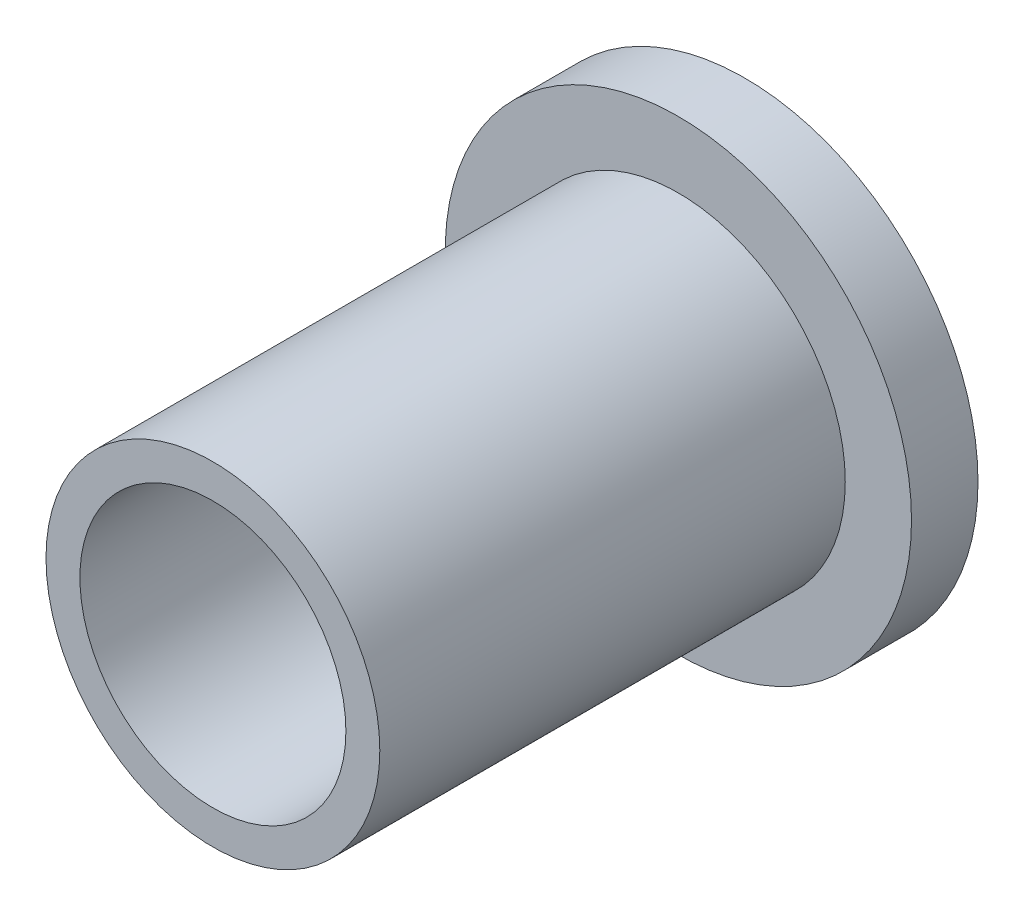
ISO-10303-21;
HEADER;
FILE_DESCRIPTION(('STEP AP214'),'2;1');
FILE_NAME('part.step','',(''),(''),'','','');
FILE_SCHEMA(('AUTOMOTIVE_DESIGN { 1 0 10303 214 1 1 1 1 }'));
ENDSEC;
DATA;
#1=APPLICATION_CONTEXT('core data for automotive mechanical design processes');
#2=APPLICATION_PROTOCOL_DEFINITION('international standard','automotive_design',2000,#1);
#3=PRODUCT_CONTEXT('',#1,'mechanical');
#4=PRODUCT('Part','Part','',(#3));
#5=PRODUCT_RELATED_PRODUCT_CATEGORY('part','',(#4));
#6=PRODUCT_DEFINITION_FORMATION('','',#4);
#7=PRODUCT_DEFINITION_CONTEXT('part definition',#1,'design');
#8=PRODUCT_DEFINITION('design','',#6,#7);
#9=PRODUCT_DEFINITION_SHAPE('','',#8);
#10=(LENGTH_UNIT() NAMED_UNIT(*) SI_UNIT(.MILLI.,.METRE.));
#11=(NAMED_UNIT(*) PLANE_ANGLE_UNIT() SI_UNIT($,.RADIAN.));
#12=(NAMED_UNIT(*) SI_UNIT($,.STERADIAN.) SOLID_ANGLE_UNIT());
#13=UNCERTAINTY_MEASURE_WITH_UNIT(LENGTH_MEASURE(1.E-05),#10,'distance_accuracy_value','');
#14=(GEOMETRIC_REPRESENTATION_CONTEXT(3) GLOBAL_UNCERTAINTY_ASSIGNED_CONTEXT((#13)) GLOBAL_UNIT_ASSIGNED_CONTEXT((#10,
#11,#12)) REPRESENTATION_CONTEXT('',''));
#15=CARTESIAN_POINT('',(0.,0.,0.));
#16=DIRECTION('',(0.,0.,1.));
#17=DIRECTION('',(1.,0.,0.));
#18=AXIS2_PLACEMENT_3D('',#15,#16,#17);
#19=CARTESIAN_POINT('',(0.,0.,3.175));
#20=DIRECTION('',(0.,0.,1.));
#21=DIRECTION('',(1.,0.,0.));
#22=AXIS2_PLACEMENT_3D('',#19,#20,#21);
#23=PLANE('',#22);
#24=CARTESIAN_POINT('',(0.,0.,3.175));
#25=DIRECTION('',(0.,0.,1.));
#26=DIRECTION('',(1.,0.,0.));
#27=AXIS2_PLACEMENT_3D('',#24,#25,#26);
#28=CIRCLE('',#27,11.13155);
#29=CARTESIAN_POINT('',(11.13155,0.,3.175));
#30=VERTEX_POINT('',#29);
#31=EDGE_CURVE('E10',#30,#30,#28,.T.);
#32=ORIENTED_EDGE('',*,*,#31,.T.);
#33=EDGE_LOOP('',(#32));
#34=FACE_BOUND('',#33,.T.);
#35=CARTESIAN_POINT('',(0.,0.,3.175));
#36=DIRECTION('',(0.,0.,1.));
#37=DIRECTION('',(1.,0.,0.));
#38=AXIS2_PLACEMENT_3D('',#35,#36,#37);
#39=CIRCLE('',#38,7.96925);
#40=CARTESIAN_POINT('',(7.96925,0.,3.175));
#41=VERTEX_POINT('',#40);
#42=EDGE_CURVE('E52',#41,#41,#39,.T.);
#43=ORIENTED_EDGE('',*,*,#42,.F.);
#44=EDGE_LOOP('',(#43));
#45=FACE_BOUND('',#44,.T.);
#46=ADVANCED_FACE('F36',(#34,#45),#23,.T.);
#47=CARTESIAN_POINT('',(0.,0.,0.));
#48=DIRECTION('',(0.,0.,1.));
#49=DIRECTION('',(1.,0.,0.));
#50=AXIS2_PLACEMENT_3D('',#47,#48,#49);
#51=PLANE('',#50);
#52=CARTESIAN_POINT('',(0.,0.,0.));
#53=DIRECTION('',(0.,0.,1.));
#54=DIRECTION('',(1.,0.,0.));
#55=AXIS2_PLACEMENT_3D('',#52,#53,#54);
#56=CIRCLE('',#55,11.13155);
#57=CARTESIAN_POINT('',(11.13155,0.,0.));
#58=VERTEX_POINT('',#57);
#59=EDGE_CURVE('E40',#58,#58,#56,.T.);
#60=ORIENTED_EDGE('',*,*,#59,.F.);
#61=EDGE_LOOP('',(#60));
#62=FACE_BOUND('',#61,.T.);
#63=CARTESIAN_POINT('',(0.,0.,0.));
#64=DIRECTION('',(0.,0.,1.));
#65=DIRECTION('',(1.,0.,0.));
#66=AXIS2_PLACEMENT_3D('',#63,#64,#65);
#67=CIRCLE('',#66,6.35);
#68=CARTESIAN_POINT('',(6.35,0.,0.));
#69=VERTEX_POINT('',#68);
#70=EDGE_CURVE('E47',#69,#69,#67,.T.);
#71=ORIENTED_EDGE('',*,*,#70,.T.);
#72=EDGE_LOOP('',(#71));
#73=FACE_BOUND('',#72,.T.);
#74=ADVANCED_FACE('F77',(#62,#73),#51,.F.);
#75=CARTESIAN_POINT('',(0.,0.,3.175));
#76=DIRECTION('',(0.,0.,-1.));
#77=DIRECTION('',(-1.,0.,0.));
#78=AXIS2_PLACEMENT_3D('',#75,#76,#77);
#79=CYLINDRICAL_SURFACE('',#78,11.13155);
#80=ORIENTED_EDGE('',*,*,#31,.F.);
#81=EDGE_LOOP('',(#80));
#82=FACE_BOUND('',#81,.T.);
#83=ORIENTED_EDGE('',*,*,#59,.T.);
#84=EDGE_LOOP('',(#83));
#85=FACE_BOUND('',#84,.T.);
#86=ADVANCED_FACE('F38',(#82,#85),#79,.T.);
#87=CARTESIAN_POINT('',(0.,0.,3.175));
#88=DIRECTION('',(0.,0.,-1.));
#89=DIRECTION('',(-1.,0.,0.));
#90=AXIS2_PLACEMENT_3D('',#87,#88,#89);
#91=CYLINDRICAL_SURFACE('',#90,6.35);
#92=ORIENTED_EDGE('',*,*,#70,.F.);
#93=EDGE_LOOP('',(#92));
#94=FACE_BOUND('',#93,.T.);
#95=CARTESIAN_POINT('',(0.,0.,25.4));
#96=DIRECTION('',(0.,0.,1.));
#97=DIRECTION('',(1.,0.,0.));
#98=AXIS2_PLACEMENT_3D('',#95,#96,#97);
#99=CIRCLE('',#98,6.35);
#100=CARTESIAN_POINT('',(6.35,0.,25.4));
#101=VERTEX_POINT('',#100);
#102=EDGE_CURVE('E55',#101,#101,#99,.T.);
#103=ORIENTED_EDGE('',*,*,#102,.T.);
#104=EDGE_LOOP('',(#103));
#105=FACE_BOUND('',#104,.T.);
#106=ADVANCED_FACE('F61',(#94,#105),#91,.F.);
#107=CARTESIAN_POINT('',(0.,0.,25.4));
#108=DIRECTION('',(0.,0.,1.));
#109=DIRECTION('',(1.,0.,0.));
#110=AXIS2_PLACEMENT_3D('',#107,#108,#109);
#111=PLANE('',#110);
#112=CARTESIAN_POINT('',(0.,0.,25.4));
#113=DIRECTION('',(0.,0.,1.));
#114=DIRECTION('',(1.,0.,0.));
#115=AXIS2_PLACEMENT_3D('',#112,#113,#114);
#116=CIRCLE('',#115,7.96925);
#117=CARTESIAN_POINT('',(7.96925,0.,25.4));
#118=VERTEX_POINT('',#117);
#119=EDGE_CURVE('E51',#118,#118,#116,.T.);
#120=ORIENTED_EDGE('',*,*,#119,.T.);
#121=EDGE_LOOP('',(#120));
#122=FACE_BOUND('',#121,.T.);
#123=ORIENTED_EDGE('',*,*,#102,.F.);
#124=EDGE_LOOP('',(#123));
#125=FACE_BOUND('',#124,.T.);
#126=ADVANCED_FACE('F63',(#122,#125),#111,.T.);
#127=CARTESIAN_POINT('',(0.,0.,25.4));
#128=DIRECTION('',(0.,0.,-1.));
#129=DIRECTION('',(-1.,0.,0.));
#130=AXIS2_PLACEMENT_3D('',#127,#128,#129);
#131=CYLINDRICAL_SURFACE('',#130,7.96925);
#132=ORIENTED_EDGE('',*,*,#119,.F.);
#133=EDGE_LOOP('',(#132));
#134=FACE_BOUND('',#133,.T.);
#135=ORIENTED_EDGE('',*,*,#42,.T.);
#136=EDGE_LOOP('',(#135));
#137=FACE_BOUND('',#136,.T.);
#138=ADVANCED_FACE('F65',(#134,#137),#131,.T.);
#139=CLOSED_SHELL('',(#46,#74,#86,#106,#126,#138));
#140=MANIFOLD_SOLID_BREP('B2',#139);
#141=ADVANCED_BREP_SHAPE_REPRESENTATION('',(#18,#140),#14);
#142=SHAPE_DEFINITION_REPRESENTATION(#9,#141);
ENDSEC;
END-ISO-10303-21;
